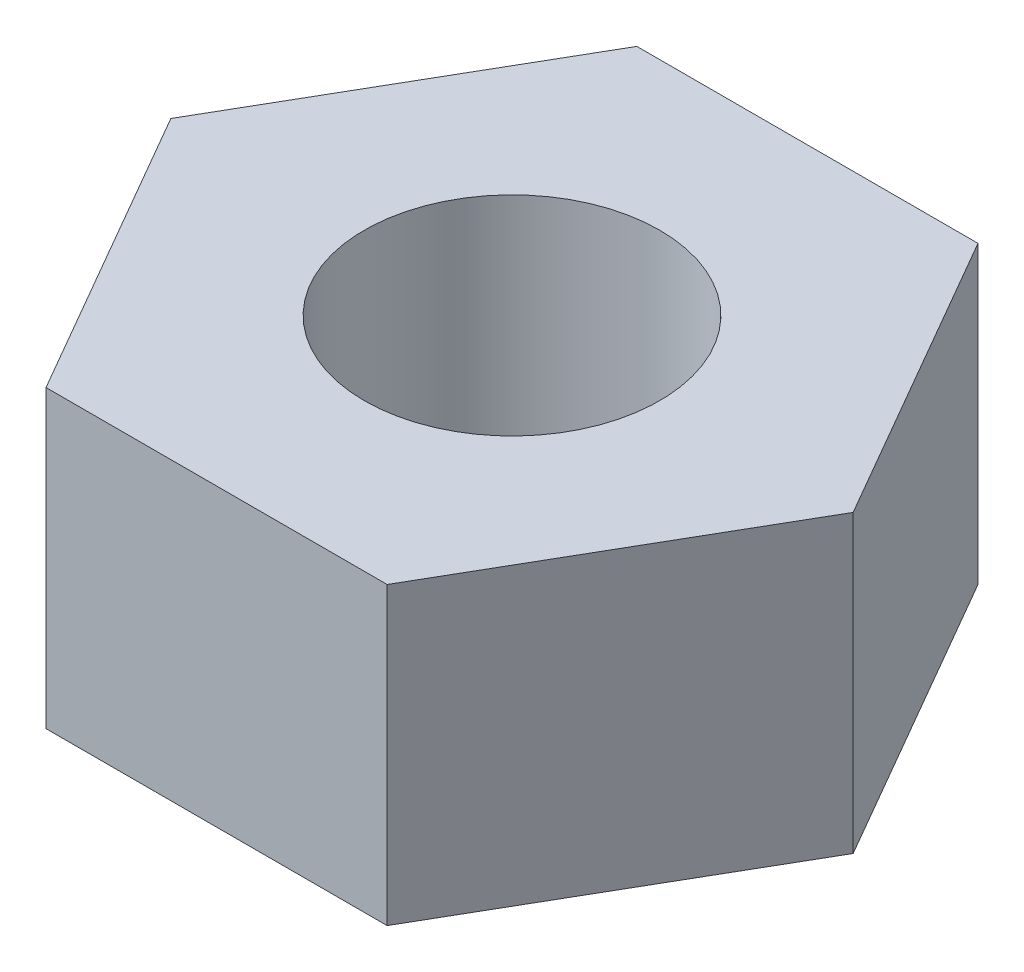
ISO-10303-21;
HEADER;
FILE_DESCRIPTION(('STEP AP214'),'2;1');
FILE_NAME('part.step','',(''),(''),'','','');
FILE_SCHEMA(('AUTOMOTIVE_DESIGN { 1 0 10303 214 1 1 1 1 }'));
ENDSEC;
DATA;
#1=APPLICATION_CONTEXT('core data for automotive mechanical design processes');
#2=APPLICATION_PROTOCOL_DEFINITION('international standard','automotive_design',2000,#1);
#3=PRODUCT_CONTEXT('',#1,'mechanical');
#4=PRODUCT('Part','Part','',(#3));
#5=PRODUCT_RELATED_PRODUCT_CATEGORY('part','',(#4));
#6=PRODUCT_DEFINITION_FORMATION('','',#4);
#7=PRODUCT_DEFINITION_CONTEXT('part definition',#1,'design');
#8=PRODUCT_DEFINITION('design','',#6,#7);
#9=PRODUCT_DEFINITION_SHAPE('','',#8);
#10=(LENGTH_UNIT() NAMED_UNIT(*) SI_UNIT(.MILLI.,.METRE.));
#11=(NAMED_UNIT(*) PLANE_ANGLE_UNIT() SI_UNIT($,.RADIAN.));
#12=(NAMED_UNIT(*) SI_UNIT($,.STERADIAN.) SOLID_ANGLE_UNIT());
#13=UNCERTAINTY_MEASURE_WITH_UNIT(LENGTH_MEASURE(1.E-05),#10,'distance_accuracy_value','');
#14=(GEOMETRIC_REPRESENTATION_CONTEXT(3) GLOBAL_UNCERTAINTY_ASSIGNED_CONTEXT((#13)) GLOBAL_UNIT_ASSIGNED_CONTEXT((#10,
#11,#12)) REPRESENTATION_CONTEXT('',''));
#15=CARTESIAN_POINT('',(0.,0.,0.));
#16=DIRECTION('',(0.,0.,1.));
#17=DIRECTION('',(1.,0.,0.));
#18=AXIS2_PLACEMENT_3D('',#15,#16,#17);
#19=CARTESIAN_POINT('',(0.,10.,0.));
#20=DIRECTION('',(0.,1.,0.));
#21=DIRECTION('',(0.,0.,1.));
#22=AXIS2_PLACEMENT_3D('',#19,#20,#21);
#23=PLANE('',#22);
#24=DIRECTION('',(0.5,0.,-0.866025403784438));
#25=VECTOR('',#24,1.);
#26=CARTESIAN_POINT('',(5.77350269189626,10.,10.));
#27=LINE('',#26,#25);
#28=CARTESIAN_POINT('',(5.77350269189626,10.,10.));
#29=VERTEX_POINT('',#28);
#30=CARTESIAN_POINT('',(11.5470053837925,10.,0.));
#31=VERTEX_POINT('',#30);
#32=EDGE_CURVE('E150',#29,#31,#27,.T.);
#33=ORIENTED_EDGE('',*,*,#32,.T.);
#34=DIRECTION('',(-0.500000000000001,0.,-0.866025403784438));
#35=VECTOR('',#34,1.);
#36=CARTESIAN_POINT('',(11.5470053837925,10.,0.));
#37=LINE('',#36,#35);
#38=CARTESIAN_POINT('',(5.77350269189626,10.,-10.));
#39=VERTEX_POINT('',#38);
#40=EDGE_CURVE('E98',#31,#39,#37,.T.);
#41=ORIENTED_EDGE('',*,*,#40,.T.);
#42=DIRECTION('',(-1.,0.,0.));
#43=VECTOR('',#42,1.);
#44=CARTESIAN_POINT('',(5.77350269189626,10.,-10.));
#45=LINE('',#44,#43);
#46=CARTESIAN_POINT('',(-5.77350269189626,10.,-10.));
#47=VERTEX_POINT('',#46);
#48=EDGE_CURVE('E111',#39,#47,#45,.T.);
#49=ORIENTED_EDGE('',*,*,#48,.T.);
#50=DIRECTION('',(-0.5,0.,0.866025403784439));
#51=VECTOR('',#50,1.);
#52=CARTESIAN_POINT('',(-5.77350269189626,10.,-10.));
#53=LINE('',#52,#51);
#54=CARTESIAN_POINT('',(-11.5470053837925,10.,0.));
#55=VERTEX_POINT('',#54);
#56=EDGE_CURVE('E105',#47,#55,#53,.T.);
#57=ORIENTED_EDGE('',*,*,#56,.T.);
#58=DIRECTION('',(0.5,0.,0.866025403784438));
#59=VECTOR('',#58,1.);
#60=CARTESIAN_POINT('',(-11.5470053837925,10.,0.));
#61=LINE('',#60,#59);
#62=CARTESIAN_POINT('',(-5.77350269189625,10.,10.));
#63=VERTEX_POINT('',#62);
#64=EDGE_CURVE('E109',#55,#63,#61,.T.);
#65=ORIENTED_EDGE('',*,*,#64,.T.);
#66=DIRECTION('',(1.,0.,0.));
#67=VECTOR('',#66,1.);
#68=CARTESIAN_POINT('',(-5.77350269189625,10.,10.));
#69=LINE('',#68,#67);
#70=EDGE_CURVE('E61',#63,#29,#69,.T.);
#71=ORIENTED_EDGE('',*,*,#70,.T.);
#72=EDGE_LOOP('',(#33,#41,#49,#57,#65,#71));
#73=FACE_BOUND('',#72,.T.);
#74=CARTESIAN_POINT('',(0.,10.,0.));
#75=DIRECTION('',(0.,1.,0.));
#76=DIRECTION('',(0.,0.,1.));
#77=AXIS2_PLACEMENT_3D('',#74,#75,#76);
#78=CIRCLE('',#77,5.);
#79=CARTESIAN_POINT('',(0.,10.,5.));
#80=VERTEX_POINT('',#79);
#81=EDGE_CURVE('E138',#80,#80,#78,.T.);
#82=ORIENTED_EDGE('',*,*,#81,.F.);
#83=EDGE_LOOP('',(#82));
#84=FACE_BOUND('',#83,.T.);
#85=ADVANCED_FACE('F43',(#73,#84),#23,.T.);
#86=CARTESIAN_POINT('',(0.,0.,0.));
#87=DIRECTION('',(0.,1.,0.));
#88=DIRECTION('',(0.,0.,1.));
#89=AXIS2_PLACEMENT_3D('',#86,#87,#88);
#90=PLANE('',#89);
#91=DIRECTION('',(0.5,0.,-0.866025403784438));
#92=VECTOR('',#91,1.);
#93=CARTESIAN_POINT('',(5.77350269189626,0.,10.));
#94=LINE('',#93,#92);
#95=CARTESIAN_POINT('',(5.77350269189626,0.,10.));
#96=VERTEX_POINT('',#95);
#97=CARTESIAN_POINT('',(11.5470053837925,0.,0.));
#98=VERTEX_POINT('',#97);
#99=EDGE_CURVE('E133',#96,#98,#94,.T.);
#100=ORIENTED_EDGE('',*,*,#99,.F.);
#101=DIRECTION('',(1.,0.,0.));
#102=VECTOR('',#101,1.);
#103=CARTESIAN_POINT('',(-5.77350269189625,0.,10.));
#104=LINE('',#103,#102);
#105=CARTESIAN_POINT('',(-5.77350269189625,0.,10.));
#106=VERTEX_POINT('',#105);
#107=EDGE_CURVE('E90',#106,#96,#104,.T.);
#108=ORIENTED_EDGE('',*,*,#107,.F.);
#109=DIRECTION('',(0.5,0.,0.866025403784438));
#110=VECTOR('',#109,1.);
#111=CARTESIAN_POINT('',(-11.5470053837925,0.,0.));
#112=LINE('',#111,#110);
#113=CARTESIAN_POINT('',(-11.5470053837925,0.,0.));
#114=VERTEX_POINT('',#113);
#115=EDGE_CURVE('E84',#114,#106,#112,.T.);
#116=ORIENTED_EDGE('',*,*,#115,.F.);
#117=DIRECTION('',(-0.5,0.,0.866025403784439));
#118=VECTOR('',#117,1.);
#119=CARTESIAN_POINT('',(-5.77350269189626,0.,-10.));
#120=LINE('',#119,#118);
#121=CARTESIAN_POINT('',(-5.77350269189626,0.,-10.));
#122=VERTEX_POINT('',#121);
#123=EDGE_CURVE('E120',#122,#114,#120,.T.);
#124=ORIENTED_EDGE('',*,*,#123,.F.);
#125=DIRECTION('',(-1.,0.,0.));
#126=VECTOR('',#125,1.);
#127=CARTESIAN_POINT('',(5.77350269189626,0.,-10.));
#128=LINE('',#127,#126);
#129=CARTESIAN_POINT('',(5.77350269189626,0.,-10.));
#130=VERTEX_POINT('',#129);
#131=EDGE_CURVE('E141',#130,#122,#128,.T.);
#132=ORIENTED_EDGE('',*,*,#131,.F.);
#133=DIRECTION('',(-0.500000000000001,0.,-0.866025403784438));
#134=VECTOR('',#133,1.);
#135=CARTESIAN_POINT('',(11.5470053837925,0.,0.));
#136=LINE('',#135,#134);
#137=EDGE_CURVE('E137',#98,#130,#136,.T.);
#138=ORIENTED_EDGE('',*,*,#137,.F.);
#139=EDGE_LOOP('',(#100,#108,#116,#124,#132,#138));
#140=FACE_BOUND('',#139,.T.);
#141=CARTESIAN_POINT('',(0.,0.,0.));
#142=DIRECTION('',(0.,1.,0.));
#143=DIRECTION('',(0.,0.,1.));
#144=AXIS2_PLACEMENT_3D('',#141,#142,#143);
#145=CIRCLE('',#144,5.);
#146=CARTESIAN_POINT('',(0.,0.,5.));
#147=VERTEX_POINT('',#146);
#148=EDGE_CURVE('E265',#147,#147,#145,.T.);
#149=ORIENTED_EDGE('',*,*,#148,.T.);
#150=EDGE_LOOP('',(#149));
#151=FACE_BOUND('',#150,.T.);
#152=ADVANCED_FACE('F163',(#140,#151),#90,.F.);
#153=CARTESIAN_POINT('',(5.77350269189626,10.,10.));
#154=DIRECTION('',(-0.866025403784439,0.,-0.5));
#155=DIRECTION('',(-0.5,0.,0.866025403784439));
#156=AXIS2_PLACEMENT_3D('',#153,#154,#155);
#157=PLANE('',#156);
#158=ORIENTED_EDGE('',*,*,#99,.T.);
#159=DIRECTION('',(0.,-1.,0.));
#160=VECTOR('',#159,1.);
#161=CARTESIAN_POINT('',(11.5470053837925,10.,0.));
#162=LINE('',#161,#160);
#163=EDGE_CURVE('E11',#31,#98,#162,.T.);
#164=ORIENTED_EDGE('',*,*,#163,.F.);
#165=ORIENTED_EDGE('',*,*,#32,.F.);
#166=DIRECTION('',(0.,-1.,0.));
#167=VECTOR('',#166,1.);
#168=CARTESIAN_POINT('',(5.77350269189626,10.,10.));
#169=LINE('',#168,#167);
#170=EDGE_CURVE('E129',#29,#96,#169,.T.);
#171=ORIENTED_EDGE('',*,*,#170,.T.);
#172=EDGE_LOOP('',(#158,#164,#165,#171));
#173=FACE_BOUND('',#172,.T.);
#174=ADVANCED_FACE('F45',(#173),#157,.F.);
#175=CARTESIAN_POINT('',(11.5470053837925,10.,0.));
#176=DIRECTION('',(-0.866025403784438,0.,0.500000000000001));
#177=DIRECTION('',(0.500000000000001,0.,0.866025403784438));
#178=AXIS2_PLACEMENT_3D('',#175,#176,#177);
#179=PLANE('',#178);
#180=ORIENTED_EDGE('',*,*,#137,.T.);
#181=DIRECTION('',(0.,-1.,0.));
#182=VECTOR('',#181,1.);
#183=CARTESIAN_POINT('',(5.77350269189626,10.,-10.));
#184=LINE('',#183,#182);
#185=EDGE_CURVE('E53',#39,#130,#184,.T.);
#186=ORIENTED_EDGE('',*,*,#185,.F.);
#187=ORIENTED_EDGE('',*,*,#40,.F.);
#188=ORIENTED_EDGE('',*,*,#163,.T.);
#189=EDGE_LOOP('',(#180,#186,#187,#188));
#190=FACE_BOUND('',#189,.T.);
#191=ADVANCED_FACE('F188',(#190),#179,.F.);
#192=CARTESIAN_POINT('',(5.77350269189626,10.,-10.));
#193=DIRECTION('',(0.,0.,1.));
#194=DIRECTION('',(1.,0.,0.));
#195=AXIS2_PLACEMENT_3D('',#192,#193,#194);
#196=PLANE('',#195);
#197=ORIENTED_EDGE('',*,*,#131,.T.);
#198=DIRECTION('',(0.,-1.,0.));
#199=VECTOR('',#198,1.);
#200=CARTESIAN_POINT('',(-5.77350269189626,10.,-10.));
#201=LINE('',#200,#199);
#202=EDGE_CURVE('E122',#47,#122,#201,.T.);
#203=ORIENTED_EDGE('',*,*,#202,.F.);
#204=ORIENTED_EDGE('',*,*,#48,.F.);
#205=ORIENTED_EDGE('',*,*,#185,.T.);
#206=EDGE_LOOP('',(#197,#203,#204,#205));
#207=FACE_BOUND('',#206,.T.);
#208=ADVANCED_FACE('F160',(#207),#196,.F.);
#209=CARTESIAN_POINT('',(-5.77350269189626,10.,-10.));
#210=DIRECTION('',(0.866025403784439,0.,0.5));
#211=DIRECTION('',(0.5,0.,-0.866025403784439));
#212=AXIS2_PLACEMENT_3D('',#209,#210,#211);
#213=PLANE('',#212);
#214=ORIENTED_EDGE('',*,*,#123,.T.);
#215=DIRECTION('',(0.,-1.,0.));
#216=VECTOR('',#215,1.);
#217=CARTESIAN_POINT('',(-11.5470053837925,10.,0.));
#218=LINE('',#217,#216);
#219=EDGE_CURVE('E117',#55,#114,#218,.T.);
#220=ORIENTED_EDGE('',*,*,#219,.F.);
#221=ORIENTED_EDGE('',*,*,#56,.F.);
#222=ORIENTED_EDGE('',*,*,#202,.T.);
#223=EDGE_LOOP('',(#214,#220,#221,#222));
#224=FACE_BOUND('',#223,.T.);
#225=ADVANCED_FACE('F118',(#224),#213,.F.);
#226=CARTESIAN_POINT('',(-11.5470053837925,10.,0.));
#227=DIRECTION('',(0.866025403784438,0.,-0.5));
#228=DIRECTION('',(-0.5,0.,-0.866025403784439));
#229=AXIS2_PLACEMENT_3D('',#226,#227,#228);
#230=PLANE('',#229);
#231=ORIENTED_EDGE('',*,*,#115,.T.);
#232=DIRECTION('',(0.,-1.,0.));
#233=VECTOR('',#232,1.);
#234=CARTESIAN_POINT('',(-5.77350269189625,10.,10.));
#235=LINE('',#234,#233);
#236=EDGE_CURVE('E123',#63,#106,#235,.T.);
#237=ORIENTED_EDGE('',*,*,#236,.F.);
#238=ORIENTED_EDGE('',*,*,#64,.F.);
#239=ORIENTED_EDGE('',*,*,#219,.T.);
#240=EDGE_LOOP('',(#231,#237,#238,#239));
#241=FACE_BOUND('',#240,.T.);
#242=ADVANCED_FACE('F125',(#241),#230,.F.);
#243=CARTESIAN_POINT('',(-5.77350269189625,10.,10.));
#244=DIRECTION('',(0.,0.,-1.));
#245=DIRECTION('',(-1.,0.,0.));
#246=AXIS2_PLACEMENT_3D('',#243,#244,#245);
#247=PLANE('',#246);
#248=ORIENTED_EDGE('',*,*,#107,.T.);
#249=ORIENTED_EDGE('',*,*,#170,.F.);
#250=ORIENTED_EDGE('',*,*,#70,.F.);
#251=ORIENTED_EDGE('',*,*,#236,.T.);
#252=EDGE_LOOP('',(#248,#249,#250,#251));
#253=FACE_BOUND('',#252,.T.);
#254=ADVANCED_FACE('F168',(#253),#247,.F.);
#255=CARTESIAN_POINT('',(0.,10.,0.));
#256=DIRECTION('',(0.,-1.,0.));
#257=DIRECTION('',(0.,0.,-1.));
#258=AXIS2_PLACEMENT_3D('',#255,#256,#257);
#259=CYLINDRICAL_SURFACE('',#258,5.);
#260=ORIENTED_EDGE('',*,*,#81,.T.);
#261=EDGE_LOOP('',(#260));
#262=FACE_BOUND('',#261,.T.);
#263=ORIENTED_EDGE('',*,*,#148,.F.);
#264=EDGE_LOOP('',(#263));
#265=FACE_BOUND('',#264,.T.);
#266=ADVANCED_FACE('F170',(#262,#265),#259,.F.);
#267=CLOSED_SHELL('',(#85,#152,#174,#191,#208,#225,#242,#254,#266));
#268=MANIFOLD_SOLID_BREP('B2',#267);
#269=ADVANCED_BREP_SHAPE_REPRESENTATION('',(#18,#268),#14);
#270=SHAPE_DEFINITION_REPRESENTATION(#9,#269);
ENDSEC;
END-ISO-10303-21;
